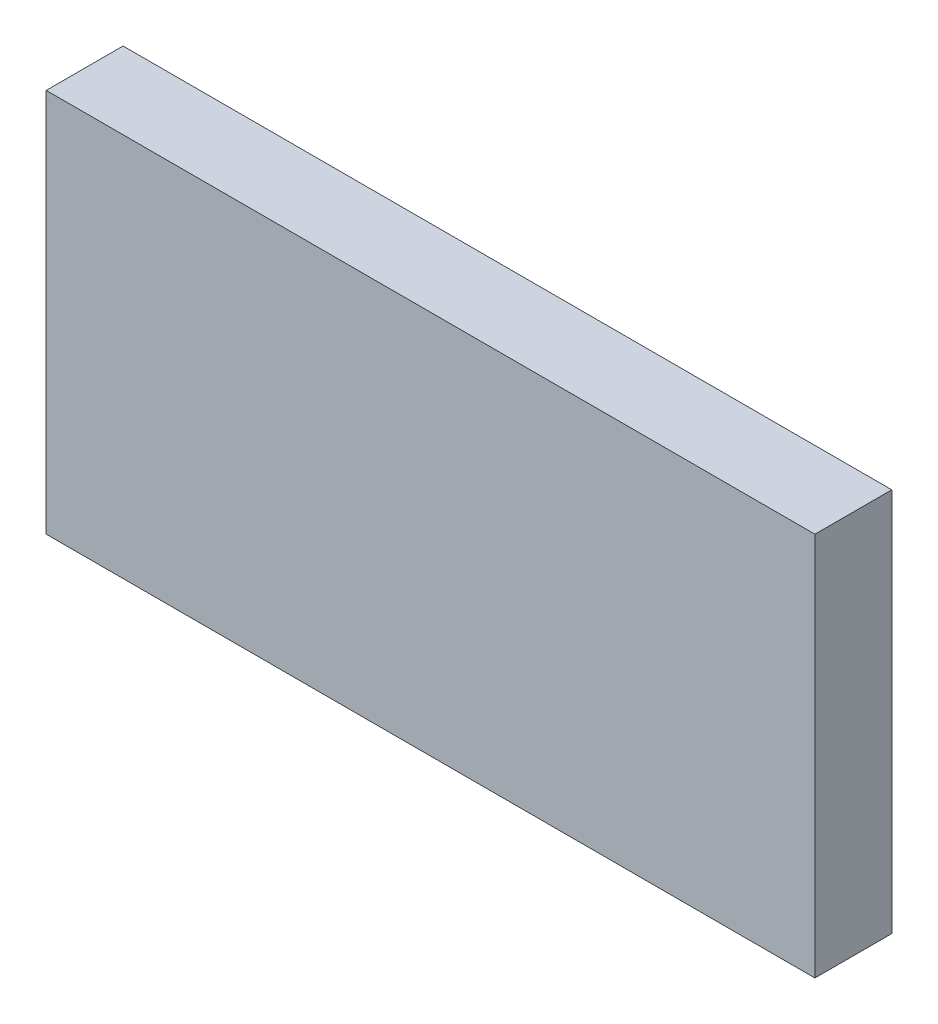
ISO-10303-21;
HEADER;
FILE_DESCRIPTION(('STEP AP214'),'2;1');
FILE_NAME('part.step','',(''),(''),'','','');
FILE_SCHEMA(('AUTOMOTIVE_DESIGN { 1 0 10303 214 1 1 1 1 }'));
ENDSEC;
DATA;
#1=APPLICATION_CONTEXT('core data for automotive mechanical design processes');
#2=APPLICATION_PROTOCOL_DEFINITION('international standard','automotive_design',2000,#1);
#3=PRODUCT_CONTEXT('',#1,'mechanical');
#4=PRODUCT('Part','Part','',(#3));
#5=PRODUCT_RELATED_PRODUCT_CATEGORY('part','',(#4));
#6=PRODUCT_DEFINITION_FORMATION('','',#4);
#7=PRODUCT_DEFINITION_CONTEXT('part definition',#1,'design');
#8=PRODUCT_DEFINITION('design','',#6,#7);
#9=PRODUCT_DEFINITION_SHAPE('','',#8);
#10=(LENGTH_UNIT() NAMED_UNIT(*) SI_UNIT(.MILLI.,.METRE.));
#11=(NAMED_UNIT(*) PLANE_ANGLE_UNIT() SI_UNIT($,.RADIAN.));
#12=(NAMED_UNIT(*) SI_UNIT($,.STERADIAN.) SOLID_ANGLE_UNIT());
#13=UNCERTAINTY_MEASURE_WITH_UNIT(LENGTH_MEASURE(1.E-05),#10,'distance_accuracy_value','');
#14=(GEOMETRIC_REPRESENTATION_CONTEXT(3) GLOBAL_UNCERTAINTY_ASSIGNED_CONTEXT((#13)) GLOBAL_UNIT_ASSIGNED_CONTEXT((#10,
#11,#12)) REPRESENTATION_CONTEXT('',''));
#15=CARTESIAN_POINT('',(0.,0.,0.));
#16=DIRECTION('',(0.,0.,1.));
#17=DIRECTION('',(1.,0.,0.));
#18=AXIS2_PLACEMENT_3D('',#15,#16,#17);
#19=CARTESIAN_POINT('',(-19.2159985472628,24.0017649971541,2.));
#20=DIRECTION('',(0.,-1.,0.));
#21=DIRECTION('',(0.,0.,-1.));
#22=AXIS2_PLACEMENT_3D('',#19,#20,#21);
#23=PLANE('',#22);
#24=DIRECTION('',(-1.,0.,0.));
#25=VECTOR('',#24,1.);
#26=CARTESIAN_POINT('',(-19.2159985472628,24.0017649971541,0.));
#27=LINE('',#26,#25);
#28=CARTESIAN_POINT('',(-19.2159985472628,24.0017649971541,0.));
#29=VERTEX_POINT('',#28);
#30=CARTESIAN_POINT('',(-39.2159985472628,24.0017649971541,0.));
#31=VERTEX_POINT('',#30);
#32=EDGE_CURVE('E98',#29,#31,#27,.T.);
#33=ORIENTED_EDGE('',*,*,#32,.T.);
#34=DIRECTION('',(0.,0.,-1.));
#35=VECTOR('',#34,1.);
#36=CARTESIAN_POINT('',(-39.2159985472628,24.0017649971541,2.));
#37=LINE('',#36,#35);
#38=CARTESIAN_POINT('',(-39.2159985472628,24.0017649971541,2.));
#39=VERTEX_POINT('',#38);
#40=EDGE_CURVE('E11',#39,#31,#37,.T.);
#41=ORIENTED_EDGE('',*,*,#40,.F.);
#42=DIRECTION('',(-1.,0.,0.));
#43=VECTOR('',#42,1.);
#44=CARTESIAN_POINT('',(-19.2159985472628,24.0017649971541,2.));
#45=LINE('',#44,#43);
#46=CARTESIAN_POINT('',(-19.2159985472628,24.0017649971541,2.));
#47=VERTEX_POINT('',#46);
#48=EDGE_CURVE('E86',#47,#39,#45,.T.);
#49=ORIENTED_EDGE('',*,*,#48,.F.);
#50=DIRECTION('',(0.,0.,-1.));
#51=VECTOR('',#50,1.);
#52=CARTESIAN_POINT('',(-19.2159985472628,24.0017649971541,2.));
#53=LINE('',#52,#51);
#54=EDGE_CURVE('E94',#47,#29,#53,.T.);
#55=ORIENTED_EDGE('',*,*,#54,.T.);
#56=EDGE_LOOP('',(#33,#41,#49,#55));
#57=FACE_BOUND('',#56,.T.);
#58=ADVANCED_FACE('F35',(#57),#23,.F.);
#59=CARTESIAN_POINT('',(-39.2159985472628,24.0017649971541,2.));
#60=DIRECTION('',(1.,0.,0.));
#61=DIRECTION('',(0.,0.,-1.));
#62=AXIS2_PLACEMENT_3D('',#59,#60,#61);
#63=PLANE('',#62);
#64=DIRECTION('',(0.,-1.,0.));
#65=VECTOR('',#64,1.);
#66=CARTESIAN_POINT('',(-39.2159985472628,24.0017649971541,0.));
#67=LINE('',#66,#65);
#68=CARTESIAN_POINT('',(-39.2159985472628,14.0017649971541,0.));
#69=VERTEX_POINT('',#68);
#70=EDGE_CURVE('E90',#31,#69,#67,.T.);
#71=ORIENTED_EDGE('',*,*,#70,.T.);
#72=DIRECTION('',(0.,0.,-1.));
#73=VECTOR('',#72,1.);
#74=CARTESIAN_POINT('',(-39.2159985472628,14.0017649971541,2.));
#75=LINE('',#74,#73);
#76=CARTESIAN_POINT('',(-39.2159985472628,14.0017649971541,2.));
#77=VERTEX_POINT('',#76);
#78=EDGE_CURVE('E43',#77,#69,#75,.T.);
#79=ORIENTED_EDGE('',*,*,#78,.F.);
#80=DIRECTION('',(0.,-1.,0.));
#81=VECTOR('',#80,1.);
#82=CARTESIAN_POINT('',(-39.2159985472628,24.0017649971541,2.));
#83=LINE('',#82,#81);
#84=EDGE_CURVE('E81',#39,#77,#83,.T.);
#85=ORIENTED_EDGE('',*,*,#84,.F.);
#86=ORIENTED_EDGE('',*,*,#40,.T.);
#87=EDGE_LOOP('',(#71,#79,#85,#86));
#88=FACE_BOUND('',#87,.T.);
#89=ADVANCED_FACE('F89',(#88),#63,.F.);
#90=CARTESIAN_POINT('',(-39.2159985472628,14.0017649971541,2.));
#91=DIRECTION('',(0.,1.,0.));
#92=DIRECTION('',(0.,0.,1.));
#93=AXIS2_PLACEMENT_3D('',#90,#91,#92);
#94=PLANE('',#93);
#95=DIRECTION('',(1.,0.,0.));
#96=VECTOR('',#95,1.);
#97=CARTESIAN_POINT('',(-39.2159985472628,14.0017649971541,0.));
#98=LINE('',#97,#96);
#99=CARTESIAN_POINT('',(-19.2159985472628,14.0017649971541,0.));
#100=VERTEX_POINT('',#99);
#101=EDGE_CURVE('E68',#69,#100,#98,.T.);
#102=ORIENTED_EDGE('',*,*,#101,.T.);
#103=DIRECTION('',(0.,0.,-1.));
#104=VECTOR('',#103,1.);
#105=CARTESIAN_POINT('',(-19.2159985472628,14.0017649971541,2.));
#106=LINE('',#105,#104);
#107=CARTESIAN_POINT('',(-19.2159985472628,14.0017649971541,2.));
#108=VERTEX_POINT('',#107);
#109=EDGE_CURVE('E91',#108,#100,#106,.T.);
#110=ORIENTED_EDGE('',*,*,#109,.F.);
#111=DIRECTION('',(1.,0.,0.));
#112=VECTOR('',#111,1.);
#113=CARTESIAN_POINT('',(-39.2159985472628,14.0017649971541,2.));
#114=LINE('',#113,#112);
#115=EDGE_CURVE('E84',#77,#108,#114,.T.);
#116=ORIENTED_EDGE('',*,*,#115,.F.);
#117=ORIENTED_EDGE('',*,*,#78,.T.);
#118=EDGE_LOOP('',(#102,#110,#116,#117));
#119=FACE_BOUND('',#118,.T.);
#120=ADVANCED_FACE('F92',(#119),#94,.F.);
#121=CARTESIAN_POINT('',(-19.2159985472628,14.0017649971541,2.));
#122=DIRECTION('',(-1.,0.,0.));
#123=DIRECTION('',(0.,0.,1.));
#124=AXIS2_PLACEMENT_3D('',#121,#122,#123);
#125=PLANE('',#124);
#126=DIRECTION('',(0.,1.,0.));
#127=VECTOR('',#126,1.);
#128=CARTESIAN_POINT('',(-19.2159985472628,14.0017649971541,0.));
#129=LINE('',#128,#127);
#130=EDGE_CURVE('E74',#100,#29,#129,.T.);
#131=ORIENTED_EDGE('',*,*,#130,.T.);
#132=ORIENTED_EDGE('',*,*,#54,.F.);
#133=DIRECTION('',(0.,1.,0.));
#134=VECTOR('',#133,1.);
#135=CARTESIAN_POINT('',(-19.2159985472628,14.0017649971541,2.));
#136=LINE('',#135,#134);
#137=EDGE_CURVE('E51',#108,#47,#136,.T.);
#138=ORIENTED_EDGE('',*,*,#137,.F.);
#139=ORIENTED_EDGE('',*,*,#109,.T.);
#140=EDGE_LOOP('',(#131,#132,#138,#139));
#141=FACE_BOUND('',#140,.T.);
#142=ADVANCED_FACE('F105',(#141),#125,.F.);
#143=CARTESIAN_POINT('',(0.,0.,2.));
#144=DIRECTION('',(0.,0.,1.));
#145=DIRECTION('',(1.,0.,0.));
#146=AXIS2_PLACEMENT_3D('',#143,#144,#145);
#147=PLANE('',#146);
#148=ORIENTED_EDGE('',*,*,#48,.T.);
#149=ORIENTED_EDGE('',*,*,#84,.T.);
#150=ORIENTED_EDGE('',*,*,#115,.T.);
#151=ORIENTED_EDGE('',*,*,#137,.T.);
#152=EDGE_LOOP('',(#148,#149,#150,#151));
#153=FACE_BOUND('',#152,.T.);
#154=ADVANCED_FACE('F82',(#153),#147,.T.);
#155=CARTESIAN_POINT('',(0.,0.,0.));
#156=DIRECTION('',(0.,0.,1.));
#157=DIRECTION('',(1.,0.,0.));
#158=AXIS2_PLACEMENT_3D('',#155,#156,#157);
#159=PLANE('',#158);
#160=ORIENTED_EDGE('',*,*,#32,.F.);
#161=ORIENTED_EDGE('',*,*,#130,.F.);
#162=ORIENTED_EDGE('',*,*,#101,.F.);
#163=ORIENTED_EDGE('',*,*,#70,.F.);
#164=EDGE_LOOP('',(#160,#161,#162,#163));
#165=FACE_BOUND('',#164,.T.);
#166=ADVANCED_FACE('F108',(#165),#159,.F.);
#167=CLOSED_SHELL('',(#58,#89,#120,#142,#154,#166));
#168=MANIFOLD_SOLID_BREP('B2',#167);
#169=ADVANCED_BREP_SHAPE_REPRESENTATION('',(#18,#168),#14);
#170=SHAPE_DEFINITION_REPRESENTATION(#9,#169);
ENDSEC;
END-ISO-10303-21;
